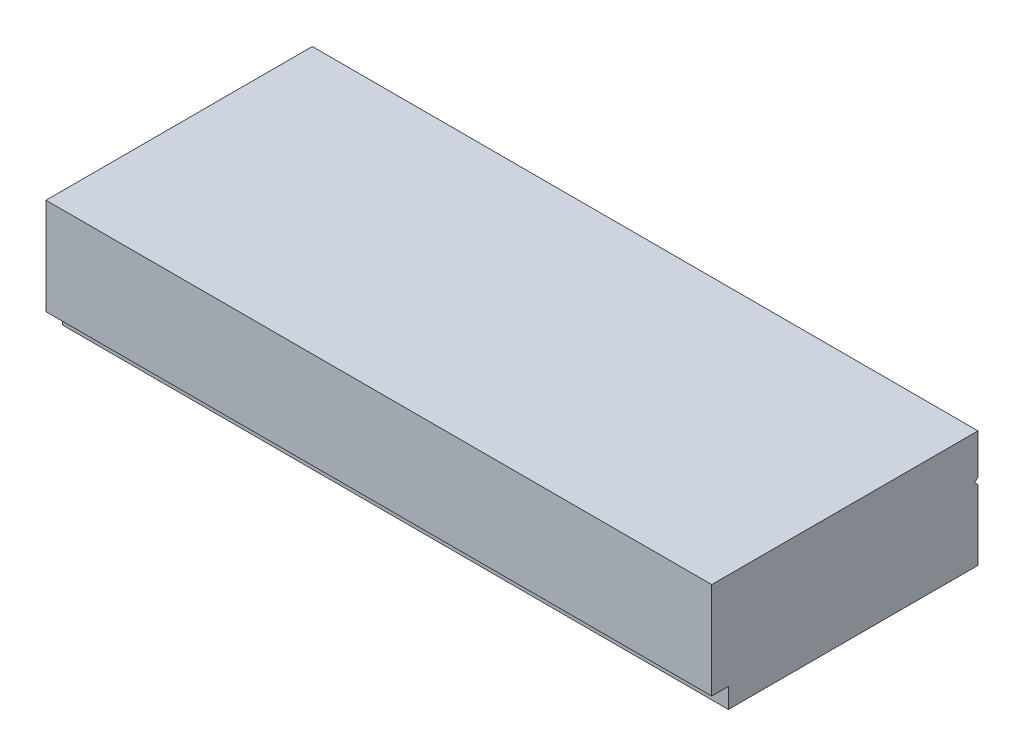
ISO-10303-21;
HEADER;
FILE_DESCRIPTION(('STEP AP214'),'2;1');
FILE_NAME('part.step','',(''),(''),'','','');
FILE_SCHEMA(('AUTOMOTIVE_DESIGN { 1 0 10303 214 1 1 1 1 }'));
ENDSEC;
DATA;
#1=APPLICATION_CONTEXT('core data for automotive mechanical design processes');
#2=APPLICATION_PROTOCOL_DEFINITION('international standard','automotive_design',2000,#1);
#3=PRODUCT_CONTEXT('',#1,'mechanical');
#4=PRODUCT('Part','Part','',(#3));
#5=PRODUCT_RELATED_PRODUCT_CATEGORY('part','',(#4));
#6=PRODUCT_DEFINITION_FORMATION('','',#4);
#7=PRODUCT_DEFINITION_CONTEXT('part definition',#1,'design');
#8=PRODUCT_DEFINITION('design','',#6,#7);
#9=PRODUCT_DEFINITION_SHAPE('','',#8);
#10=(LENGTH_UNIT() NAMED_UNIT(*) SI_UNIT(.MILLI.,.METRE.));
#11=(NAMED_UNIT(*) PLANE_ANGLE_UNIT() SI_UNIT($,.RADIAN.));
#12=(NAMED_UNIT(*) SI_UNIT($,.STERADIAN.) SOLID_ANGLE_UNIT());
#13=UNCERTAINTY_MEASURE_WITH_UNIT(LENGTH_MEASURE(1.E-05),#10,'distance_accuracy_value','');
#14=(GEOMETRIC_REPRESENTATION_CONTEXT(3) GLOBAL_UNCERTAINTY_ASSIGNED_CONTEXT((#13)) GLOBAL_UNIT_ASSIGNED_CONTEXT((#10,
#11,#12)) REPRESENTATION_CONTEXT('',''));
#15=CARTESIAN_POINT('',(0.,0.,0.));
#16=DIRECTION('',(0.,0.,1.));
#17=DIRECTION('',(1.,0.,0.));
#18=AXIS2_PLACEMENT_3D('',#15,#16,#17);
#19=CARTESIAN_POINT('',(-100.000000000001,35.,-40.0000000000004));
#20=DIRECTION('',(0.,0.,1.00000000000001));
#21=DIRECTION('',(1.00000000000001,0.,0.));
#22=AXIS2_PLACEMENT_3D('',#19,#20,#21);
#23=PLANE('',#22);
#24=DIRECTION('',(0.,-1.,0.));
#25=VECTOR('',#24,1.);
#26=CARTESIAN_POINT('',(-100.000000000001,35.,-40.0000000000004));
#27=LINE('',#26,#25);
#28=CARTESIAN_POINT('',(-100.000000000001,21.,-40.0000000000003));
#29=VERTEX_POINT('',#28);
#30=CARTESIAN_POINT('',(-100.000000000001,0.,-40.0000000000004));
#31=VERTEX_POINT('',#30);
#32=EDGE_CURVE('E125',#29,#31,#27,.T.);
#33=ORIENTED_EDGE('',*,*,#32,.F.);
#34=DIRECTION('',(1.00000000000001,0.,0.));
#35=VECTOR('',#34,1.);
#36=CARTESIAN_POINT('',(-100.000000000001,21.,-40.0000000000003));
#37=LINE('',#36,#35);
#38=CARTESIAN_POINT('',(100.000000000001,21.,-40.));
#39=VERTEX_POINT('',#38);
#40=EDGE_CURVE('E162',#29,#39,#37,.T.);
#41=ORIENTED_EDGE('',*,*,#40,.T.);
#42=DIRECTION('',(0.,-1.,0.));
#43=VECTOR('',#42,1.);
#44=CARTESIAN_POINT('',(100.000000000001,35.,-40.));
#45=LINE('',#44,#43);
#46=CARTESIAN_POINT('',(100.000000000001,1.04083408558608E-13,-40.));
#47=VERTEX_POINT('',#46);
#48=EDGE_CURVE('E42',#39,#47,#45,.T.);
#49=ORIENTED_EDGE('',*,*,#48,.T.);
#50=DIRECTION('',(-1.00000000000001,0.,0.));
#51=VECTOR('',#50,1.);
#52=CARTESIAN_POINT('',(-100.000000000001,0.,-40.0000000000004));
#53=LINE('',#52,#51);
#54=EDGE_CURVE('E138',#47,#31,#53,.T.);
#55=ORIENTED_EDGE('',*,*,#54,.T.);
#56=EDGE_LOOP('',(#33,#41,#49,#55));
#57=FACE_BOUND('',#56,.T.);
#58=ADVANCED_FACE('F34',(#57),#23,.F.);
#59=CARTESIAN_POINT('',(100.000000000001,35.,40.0000000000004));
#60=DIRECTION('',(-1.00000000000001,0.,0.));
#61=DIRECTION('',(0.,0.,1.00000000000001));
#62=AXIS2_PLACEMENT_3D('',#59,#60,#61);
#63=PLANE('',#62);
#64=ORIENTED_EDGE('',*,*,#48,.F.);
#65=DIRECTION('',(0.,-0.707106781186554,-0.707106781186545));
#66=VECTOR('',#65,1.);
#67=CARTESIAN_POINT('',(100.000000000001,22.,-39.));
#68=LINE('',#67,#66);
#69=CARTESIAN_POINT('',(100.000000000001,22.,-39.));
#70=VERTEX_POINT('',#69);
#71=EDGE_CURVE('E113',#70,#39,#68,.T.);
#72=ORIENTED_EDGE('',*,*,#71,.F.);
#73=DIRECTION('',(0.,-0.707106781186551,0.707106781186547));
#74=VECTOR('',#73,1.);
#75=CARTESIAN_POINT('',(100.000000000001,23.,-40.));
#76=LINE('',#75,#74);
#77=CARTESIAN_POINT('',(100.000000000001,23.,-40.));
#78=VERTEX_POINT('',#77);
#79=EDGE_CURVE('E171',#78,#70,#76,.T.);
#80=ORIENTED_EDGE('',*,*,#79,.F.);
#81=CARTESIAN_POINT('',(100.000000000001,35.,-40.));
#82=VERTEX_POINT('',#81);
#83=EDGE_CURVE('E11',#82,#78,#45,.T.);
#84=ORIENTED_EDGE('',*,*,#83,.F.);
#85=DIRECTION('',(0.,0.,-1.00000000000001));
#86=VECTOR('',#85,1.);
#87=CARTESIAN_POINT('',(100.000000000001,35.,40.0000000000004));
#88=LINE('',#87,#86);
#89=CARTESIAN_POINT('',(100.000000000001,35.,40.0000000000004));
#90=VERTEX_POINT('',#89);
#91=EDGE_CURVE('E137',#90,#82,#88,.T.);
#92=ORIENTED_EDGE('',*,*,#91,.F.);
#93=DIRECTION('',(0.,-1.,0.));
#94=VECTOR('',#93,1.);
#95=CARTESIAN_POINT('',(100.000000000001,35.,40.0000000000004));
#96=LINE('',#95,#94);
#97=CARTESIAN_POINT('',(100.000000000001,6.0000000000001,40.0000000000004));
#98=VERTEX_POINT('',#97);
#99=EDGE_CURVE('E130',#90,#98,#96,.T.);
#100=ORIENTED_EDGE('',*,*,#99,.T.);
#101=DIRECTION('',(0.,0.,-1.00000000000001));
#102=VECTOR('',#101,1.);
#103=CARTESIAN_POINT('',(100.000000000001,6.0000000000001,40.0000000000004));
#104=LINE('',#103,#102);
#105=CARTESIAN_POINT('',(100.000000000001,6.00000000000005,35.0000000000004));
#106=VERTEX_POINT('',#105);
#107=EDGE_CURVE('E158',#98,#106,#104,.T.);
#108=ORIENTED_EDGE('',*,*,#107,.T.);
#109=DIRECTION('',(0.,-1.,0.));
#110=VECTOR('',#109,1.);
#111=CARTESIAN_POINT('',(100.000000000001,0.,35.0000000000004));
#112=LINE('',#111,#110);
#113=CARTESIAN_POINT('',(100.000000000001,0.,35.0000000000004));
#114=VERTEX_POINT('',#113);
#115=EDGE_CURVE('E154',#106,#114,#112,.T.);
#116=ORIENTED_EDGE('',*,*,#115,.T.);
#117=DIRECTION('',(0.,0.,-1.00000000000001));
#118=VECTOR('',#117,1.);
#119=CARTESIAN_POINT('',(100.000000000001,1.04083408558608E-13,40.0000000000004));
#120=LINE('',#119,#118);
#121=EDGE_CURVE('E141',#114,#47,#120,.T.);
#122=ORIENTED_EDGE('',*,*,#121,.T.);
#123=EDGE_LOOP('',(#64,#72,#80,#84,#92,#100,#108,#116,#122));
#124=FACE_BOUND('',#123,.T.);
#125=ADVANCED_FACE('F36',(#124),#63,.F.);
#126=ORIENTED_EDGE('',*,*,#83,.T.);
#127=DIRECTION('',(1.00000000000001,0.,0.));
#128=VECTOR('',#127,1.);
#129=CARTESIAN_POINT('',(-100.000000000001,23.,-40.0000000000003));
#130=LINE('',#129,#128);
#131=CARTESIAN_POINT('',(-100.000000000001,23.,-40.0000000000003));
#132=VERTEX_POINT('',#131);
#133=EDGE_CURVE('E108',#132,#78,#130,.T.);
#134=ORIENTED_EDGE('',*,*,#133,.F.);
#135=CARTESIAN_POINT('',(-100.000000000001,35.,-40.0000000000004));
#136=VERTEX_POINT('',#135);
#137=EDGE_CURVE('E118',#136,#132,#27,.T.);
#138=ORIENTED_EDGE('',*,*,#137,.F.);
#139=DIRECTION('',(-1.00000000000001,0.,0.));
#140=VECTOR('',#139,1.);
#141=CARTESIAN_POINT('',(-100.000000000001,35.,-40.0000000000004));
#142=LINE('',#141,#140);
#143=EDGE_CURVE('E147',#82,#136,#142,.T.);
#144=ORIENTED_EDGE('',*,*,#143,.F.);
#145=EDGE_LOOP('',(#126,#134,#138,#144));
#146=FACE_BOUND('',#145,.T.);
#147=ADVANCED_FACE('F117',(#146),#23,.F.);
#148=CARTESIAN_POINT('',(-100.000000000001,35.,40.0000000000002));
#149=DIRECTION('',(1.00000000000001,0.,0.));
#150=DIRECTION('',(0.,0.,-1.00000000000001));
#151=AXIS2_PLACEMENT_3D('',#148,#149,#150);
#152=PLANE('',#151);
#153=DIRECTION('',(0.,-0.707106781186551,0.707106781186547));
#154=VECTOR('',#153,1.);
#155=CARTESIAN_POINT('',(-100.000000000001,23.,-40.0000000000003));
#156=LINE('',#155,#154);
#157=CARTESIAN_POINT('',(-100.000000000001,22.,-39.0000000000003));
#158=VERTEX_POINT('',#157);
#159=EDGE_CURVE('E104',#132,#158,#156,.T.);
#160=ORIENTED_EDGE('',*,*,#159,.T.);
#161=DIRECTION('',(0.,-0.707106781186554,-0.707106781186545));
#162=VECTOR('',#161,1.);
#163=CARTESIAN_POINT('',(-100.000000000001,22.,-39.0000000000003));
#164=LINE('',#163,#162);
#165=EDGE_CURVE('E49',#158,#29,#164,.T.);
#166=ORIENTED_EDGE('',*,*,#165,.T.);
#167=ORIENTED_EDGE('',*,*,#32,.T.);
#168=DIRECTION('',(0.,0.,1.00000000000001));
#169=VECTOR('',#168,1.);
#170=CARTESIAN_POINT('',(-100.000000000001,0.,40.));
#171=LINE('',#170,#169);
#172=CARTESIAN_POINT('',(-100.000000000001,0.,35.));
#173=VERTEX_POINT('',#172);
#174=EDGE_CURVE('E134',#31,#173,#171,.T.);
#175=ORIENTED_EDGE('',*,*,#174,.T.);
#176=DIRECTION('',(0.,-1.,0.));
#177=VECTOR('',#176,1.);
#178=CARTESIAN_POINT('',(-100.000000000001,0.,35.));
#179=LINE('',#178,#177);
#180=CARTESIAN_POINT('',(-100.000000000001,6.00000000000001,35.));
#181=VERTEX_POINT('',#180);
#182=EDGE_CURVE('E57',#181,#173,#179,.T.);
#183=ORIENTED_EDGE('',*,*,#182,.F.);
#184=DIRECTION('',(0.,0.,-1.00000000000001));
#185=VECTOR('',#184,1.);
#186=CARTESIAN_POINT('',(-100.000000000001,6.,40.));
#187=LINE('',#186,#185);
#188=CARTESIAN_POINT('',(-100.000000000001,6.,40.));
#189=VERTEX_POINT('',#188);
#190=EDGE_CURVE('E159',#189,#181,#187,.T.);
#191=ORIENTED_EDGE('',*,*,#190,.F.);
#192=DIRECTION('',(0.,-1.,0.));
#193=VECTOR('',#192,1.);
#194=CARTESIAN_POINT('',(-100.000000000001,35.,40.0000000000002));
#195=LINE('',#194,#193);
#196=CARTESIAN_POINT('',(-100.000000000001,35.,40.0000000000002));
#197=VERTEX_POINT('',#196);
#198=EDGE_CURVE('E126',#197,#189,#195,.T.);
#199=ORIENTED_EDGE('',*,*,#198,.F.);
#200=DIRECTION('',(0.,0.,1.00000000000001));
#201=VECTOR('',#200,1.);
#202=CARTESIAN_POINT('',(-100.000000000001,35.,40.0000000000002));
#203=LINE('',#202,#201);
#204=EDGE_CURVE('E124',#136,#197,#203,.T.);
#205=ORIENTED_EDGE('',*,*,#204,.F.);
#206=ORIENTED_EDGE('',*,*,#137,.T.);
#207=EDGE_LOOP('',(#160,#166,#167,#175,#183,#191,#199,#205,#206));
#208=FACE_BOUND('',#207,.T.);
#209=ADVANCED_FACE('F122',(#208),#152,.F.);
#210=CARTESIAN_POINT('',(-100.000000000001,35.,40.0000000000002));
#211=DIRECTION('',(0.,0.,-1.00000000000001));
#212=DIRECTION('',(-1.00000000000001,0.,0.));
#213=AXIS2_PLACEMENT_3D('',#210,#211,#212);
#214=PLANE('',#213);
#215=ORIENTED_EDGE('',*,*,#198,.T.);
#216=DIRECTION('',(-1.00000000000001,0.,0.));
#217=VECTOR('',#216,1.);
#218=CARTESIAN_POINT('',(100.000000000001,6.0000000000001,40.0000000000004));
#219=LINE('',#218,#217);
#220=EDGE_CURVE('E151',#98,#189,#219,.T.);
#221=ORIENTED_EDGE('',*,*,#220,.F.);
#222=ORIENTED_EDGE('',*,*,#99,.F.);
#223=DIRECTION('',(1.00000000000001,0.,0.));
#224=VECTOR('',#223,1.);
#225=CARTESIAN_POINT('',(-100.000000000001,35.,40.0000000000002));
#226=LINE('',#225,#224);
#227=EDGE_CURVE('E133',#197,#90,#226,.T.);
#228=ORIENTED_EDGE('',*,*,#227,.F.);
#229=EDGE_LOOP('',(#215,#221,#222,#228));
#230=FACE_BOUND('',#229,.T.);
#231=ADVANCED_FACE('F186',(#230),#214,.F.);
#232=CARTESIAN_POINT('',(0.,35.,0.));
#233=DIRECTION('',(0.,-1.,0.));
#234=DIRECTION('',(0.,0.,-1.00000000000001));
#235=AXIS2_PLACEMENT_3D('',#232,#233,#234);
#236=PLANE('',#235);
#237=ORIENTED_EDGE('',*,*,#91,.T.);
#238=ORIENTED_EDGE('',*,*,#143,.T.);
#239=ORIENTED_EDGE('',*,*,#204,.T.);
#240=ORIENTED_EDGE('',*,*,#227,.T.);
#241=EDGE_LOOP('',(#237,#238,#239,#240));
#242=FACE_BOUND('',#241,.T.);
#243=ADVANCED_FACE('F190',(#242),#236,.F.);
#244=CARTESIAN_POINT('',(0.,0.,0.));
#245=DIRECTION('',(0.,-1.,0.));
#246=DIRECTION('',(0.,0.,-1.00000000000001));
#247=AXIS2_PLACEMENT_3D('',#244,#245,#246);
#248=PLANE('',#247);
#249=DIRECTION('',(-1.00000000000001,0.,0.));
#250=VECTOR('',#249,1.);
#251=CARTESIAN_POINT('',(100.000000000001,0.,35.0000000000004));
#252=LINE('',#251,#250);
#253=EDGE_CURVE('E144',#114,#173,#252,.T.);
#254=ORIENTED_EDGE('',*,*,#253,.T.);
#255=ORIENTED_EDGE('',*,*,#174,.F.);
#256=ORIENTED_EDGE('',*,*,#54,.F.);
#257=ORIENTED_EDGE('',*,*,#121,.F.);
#258=EDGE_LOOP('',(#254,#255,#256,#257));
#259=FACE_BOUND('',#258,.T.);
#260=ADVANCED_FACE('F180',(#259),#248,.T.);
#261=CARTESIAN_POINT('',(100.000000000001,0.,35.0000000000004));
#262=DIRECTION('',(0.,0.,-1.00000000000001));
#263=DIRECTION('',(-1.00000000000001,0.,0.));
#264=AXIS2_PLACEMENT_3D('',#261,#262,#263);
#265=PLANE('',#264);
#266=ORIENTED_EDGE('',*,*,#182,.T.);
#267=ORIENTED_EDGE('',*,*,#253,.F.);
#268=ORIENTED_EDGE('',*,*,#115,.F.);
#269=DIRECTION('',(-1.00000000000001,0.,0.));
#270=VECTOR('',#269,1.);
#271=CARTESIAN_POINT('',(100.000000000001,6.00000000000005,35.0000000000004));
#272=LINE('',#271,#270);
#273=EDGE_CURVE('E153',#106,#181,#272,.T.);
#274=ORIENTED_EDGE('',*,*,#273,.T.);
#275=EDGE_LOOP('',(#266,#267,#268,#274));
#276=FACE_BOUND('',#275,.T.);
#277=ADVANCED_FACE('F203',(#276),#265,.F.);
#278=CARTESIAN_POINT('',(100.000000000001,6.0000000000001,40.0000000000004));
#279=DIRECTION('',(0.,1.,0.));
#280=DIRECTION('',(0.,0.,1.00000000000001));
#281=AXIS2_PLACEMENT_3D('',#278,#279,#280);
#282=PLANE('',#281);
#283=ORIENTED_EDGE('',*,*,#190,.T.);
#284=ORIENTED_EDGE('',*,*,#273,.F.);
#285=ORIENTED_EDGE('',*,*,#107,.F.);
#286=ORIENTED_EDGE('',*,*,#220,.T.);
#287=EDGE_LOOP('',(#283,#284,#285,#286));
#288=FACE_BOUND('',#287,.T.);
#289=ADVANCED_FACE('F195',(#288),#282,.F.);
#290=CARTESIAN_POINT('',(-100.000000000001,22.,-39.0000000000003));
#291=DIRECTION('',(0.,-0.707106781186541,0.707106781186557));
#292=DIRECTION('',(0.,-0.707106781186554,-0.707106781186545));
#293=AXIS2_PLACEMENT_3D('',#290,#291,#292);
#294=PLANE('',#293);
#295=ORIENTED_EDGE('',*,*,#71,.T.);
#296=ORIENTED_EDGE('',*,*,#40,.F.);
#297=ORIENTED_EDGE('',*,*,#165,.F.);
#298=DIRECTION('',(1.00000000000001,0.,0.));
#299=VECTOR('',#298,1.);
#300=CARTESIAN_POINT('',(-100.000000000001,22.,-39.0000000000003));
#301=LINE('',#300,#299);
#302=EDGE_CURVE('E110',#158,#70,#301,.T.);
#303=ORIENTED_EDGE('',*,*,#302,.T.);
#304=EDGE_LOOP('',(#295,#296,#297,#303));
#305=FACE_BOUND('',#304,.T.);
#306=ADVANCED_FACE('F193',(#305),#294,.F.);
#307=CARTESIAN_POINT('',(-100.000000000001,23.,-40.0000000000003));
#308=DIRECTION('',(0.,0.707106781186544,0.707106781186555));
#309=DIRECTION('',(0.,-0.707106781186551,0.707106781186547));
#310=AXIS2_PLACEMENT_3D('',#307,#308,#309);
#311=PLANE('',#310);
#312=ORIENTED_EDGE('',*,*,#79,.T.);
#313=ORIENTED_EDGE('',*,*,#302,.F.);
#314=ORIENTED_EDGE('',*,*,#159,.F.);
#315=ORIENTED_EDGE('',*,*,#133,.T.);
#316=EDGE_LOOP('',(#312,#313,#314,#315));
#317=FACE_BOUND('',#316,.T.);
#318=ADVANCED_FACE('F107',(#317),#311,.F.);
#319=CLOSED_SHELL('',(#58,#125,#147,#209,#231,#243,#260,#277,#289,#306,#318));
#320=MANIFOLD_SOLID_BREP('B2',#319);
#321=ADVANCED_BREP_SHAPE_REPRESENTATION('',(#18,#320),#14);
#322=SHAPE_DEFINITION_REPRESENTATION(#9,#321);
ENDSEC;
END-ISO-10303-21;
